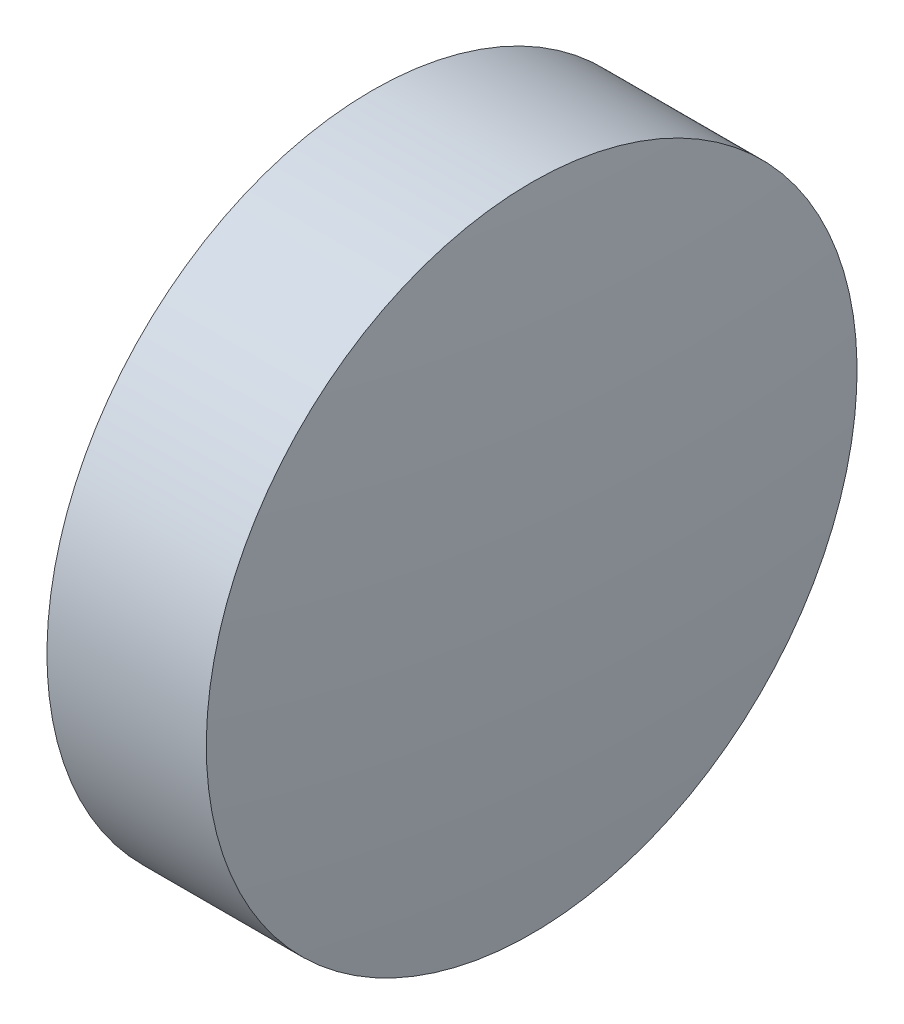
ISO-10303-21;
HEADER;
FILE_DESCRIPTION(('STEP AP214'),'2;1');
FILE_NAME('part.step','',(''),(''),'','','');
FILE_SCHEMA(('AUTOMOTIVE_DESIGN { 1 0 10303 214 1 1 1 1 }'));
ENDSEC;
DATA;
#1=APPLICATION_CONTEXT('core data for automotive mechanical design processes');
#2=APPLICATION_PROTOCOL_DEFINITION('international standard','automotive_design',2000,#1);
#3=PRODUCT_CONTEXT('',#1,'mechanical');
#4=PRODUCT('Part','Part','',(#3));
#5=PRODUCT_RELATED_PRODUCT_CATEGORY('part','',(#4));
#6=PRODUCT_DEFINITION_FORMATION('','',#4);
#7=PRODUCT_DEFINITION_CONTEXT('part definition',#1,'design');
#8=PRODUCT_DEFINITION('design','',#6,#7);
#9=PRODUCT_DEFINITION_SHAPE('','',#8);
#10=(LENGTH_UNIT() NAMED_UNIT(*) SI_UNIT(.MILLI.,.METRE.));
#11=(NAMED_UNIT(*) PLANE_ANGLE_UNIT() SI_UNIT($,.RADIAN.));
#12=(NAMED_UNIT(*) SI_UNIT($,.STERADIAN.) SOLID_ANGLE_UNIT());
#13=UNCERTAINTY_MEASURE_WITH_UNIT(LENGTH_MEASURE(1.E-05),#10,'distance_accuracy_value','');
#14=(GEOMETRIC_REPRESENTATION_CONTEXT(3) GLOBAL_UNCERTAINTY_ASSIGNED_CONTEXT((#13)) GLOBAL_UNIT_ASSIGNED_CONTEXT((#10,
#11,#12)) REPRESENTATION_CONTEXT('',''));
#15=CARTESIAN_POINT('',(0.,0.,0.));
#16=DIRECTION('',(0.,0.,1.));
#17=DIRECTION('',(1.,0.,0.));
#18=AXIS2_PLACEMENT_3D('',#15,#16,#17);
#19=CARTESIAN_POINT('',(-24.3435821591967,0.544580492999102,0.855301037688605));
#20=DIRECTION('',(1.,0.,0.));
#21=DIRECTION('',(0.,1.,0.));
#22=AXIS2_PLACEMENT_3D('',#19,#20,#21);
#23=SPHERICAL_SURFACE('',#22,27.3);
#24=CARTESIAN_POINT('',(2.79108201782966,0.544580492999102,0.855301037688605));
#25=DIRECTION('',(1.,0.,0.));
#26=DIRECTION('',(0.,1.,0.));
#27=AXIS2_PLACEMENT_3D('',#24,#25,#26);
#28=CIRCLE('',#27,3.);
#29=CARTESIAN_POINT('',(2.79108201782966,3.5445804929991,0.855301037688605));
#30=VERTEX_POINT('',#29);
#31=EDGE_CURVE('E8',#30,#30,#28,.T.);
#32=ORIENTED_EDGE('',*,*,#31,.T.);
#33=EDGE_LOOP('',(#32));
#34=FACE_BOUND('',#33,.T.);
#35=ADVANCED_FACE('F13',(#34),#23,.T.);
#36=CARTESIAN_POINT('',(2.95641784080326,0.544580492999102,0.855301037688605));
#37=DIRECTION('',(1.,0.,0.));
#38=DIRECTION('',(0.,1.,0.));
#39=AXIS2_PLACEMENT_3D('',#36,#37,#38);
#40=CYLINDRICAL_SURFACE('',#39,3.);
#41=CARTESIAN_POINT('',(1.32175366377685,0.544580492999102,0.855301037688605));
#42=DIRECTION('',(1.,0.,0.));
#43=DIRECTION('',(0.,1.,0.));
#44=AXIS2_PLACEMENT_3D('',#41,#42,#43);
#45=CIRCLE('',#44,3.);
#46=CARTESIAN_POINT('',(1.32175366377685,3.5445804929991,0.855301037688605));
#47=VERTEX_POINT('',#46);
#48=EDGE_CURVE('E19',#47,#47,#45,.T.);
#49=ORIENTED_EDGE('',*,*,#48,.T.);
#50=EDGE_LOOP('',(#49));
#51=FACE_BOUND('',#50,.T.);
#52=ORIENTED_EDGE('',*,*,#31,.F.);
#53=EDGE_LOOP('',(#52));
#54=FACE_BOUND('',#53,.T.);
#55=ADVANCED_FACE('F25',(#51,#54),#40,.T.);
#56=CARTESIAN_POINT('',(28.4564178408032,0.544580492999102,0.855301037688605));
#57=DIRECTION('',(1.,0.,0.));
#58=DIRECTION('',(0.,1.,0.));
#59=AXIS2_PLACEMENT_3D('',#56,#57,#58);
#60=SPHERICAL_SURFACE('',#59,27.3);
#61=ORIENTED_EDGE('',*,*,#48,.F.);
#62=EDGE_LOOP('',(#61));
#63=FACE_BOUND('',#62,.T.);
#64=ADVANCED_FACE('F28',(#63),#60,.T.);
#65=CLOSED_SHELL('',(#35,#55,#64));
#66=MANIFOLD_SOLID_BREP('B1',#65);
#67=ADVANCED_BREP_SHAPE_REPRESENTATION('',(#18,#66),#14);
#68=SHAPE_DEFINITION_REPRESENTATION(#9,#67);
ENDSEC;
END-ISO-10303-21;
